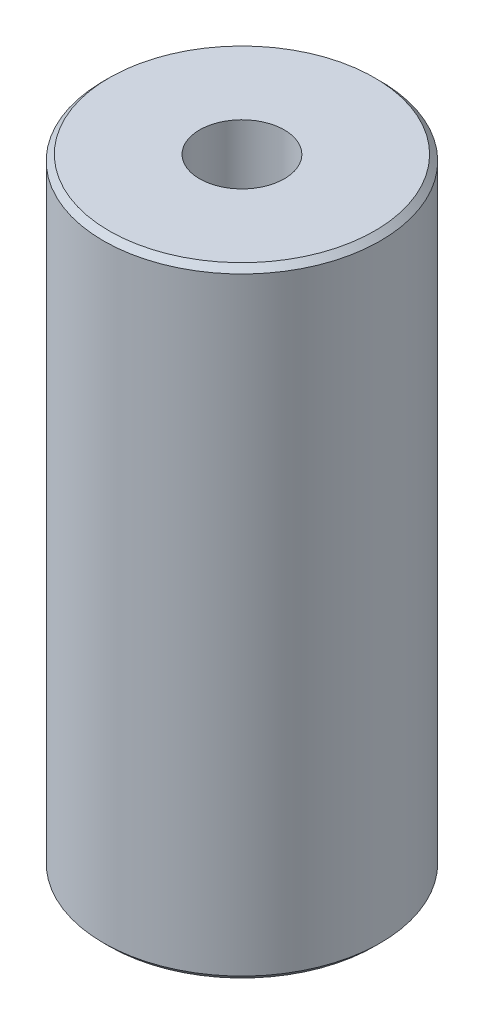
ISO-10303-21;
HEADER;
FILE_DESCRIPTION(('STEP AP214'),'2;1');
FILE_NAME('part.step','',(''),(''),'','','');
FILE_SCHEMA(('AUTOMOTIVE_DESIGN { 1 0 10303 214 1 1 1 1 }'));
ENDSEC;
DATA;
#1=APPLICATION_CONTEXT('core data for automotive mechanical design processes');
#2=APPLICATION_PROTOCOL_DEFINITION('international standard','automotive_design',2000,#1);
#3=PRODUCT_CONTEXT('',#1,'mechanical');
#4=PRODUCT('Part','Part','',(#3));
#5=PRODUCT_RELATED_PRODUCT_CATEGORY('part','',(#4));
#6=PRODUCT_DEFINITION_FORMATION('','',#4);
#7=PRODUCT_DEFINITION_CONTEXT('part definition',#1,'design');
#8=PRODUCT_DEFINITION('design','',#6,#7);
#9=PRODUCT_DEFINITION_SHAPE('','',#8);
#10=(LENGTH_UNIT() NAMED_UNIT(*) SI_UNIT(.MILLI.,.METRE.));
#11=(NAMED_UNIT(*) PLANE_ANGLE_UNIT() SI_UNIT($,.RADIAN.));
#12=(NAMED_UNIT(*) SI_UNIT($,.STERADIAN.) SOLID_ANGLE_UNIT());
#13=UNCERTAINTY_MEASURE_WITH_UNIT(LENGTH_MEASURE(1.E-05),#10,'distance_accuracy_value','');
#14=(GEOMETRIC_REPRESENTATION_CONTEXT(3) GLOBAL_UNCERTAINTY_ASSIGNED_CONTEXT((#13)) GLOBAL_UNIT_ASSIGNED_CONTEXT((#10,
#11,#12)) REPRESENTATION_CONTEXT('',''));
#15=CARTESIAN_POINT('',(0.,0.,0.));
#16=DIRECTION('',(0.,0.,1.));
#17=DIRECTION('',(1.,0.,0.));
#18=AXIS2_PLACEMENT_3D('',#15,#16,#17);
#19=CARTESIAN_POINT('',(0.,145.436498102128,0.));
#20=DIRECTION('',(0.,-1.,0.));
#21=DIRECTION('',(0.,0.,-1.));
#22=AXIS2_PLACEMENT_3D('',#19,#20,#21);
#23=CYLINDRICAL_SURFACE('',#22,32.5);
#24=CARTESIAN_POINT('',(0.,144.089113134862,0.));
#25=DIRECTION('',(0.,1.,0.));
#26=DIRECTION('',(0.,0.,1.));
#27=AXIS2_PLACEMENT_3D('',#24,#25,#26);
#28=CIRCLE('',#27,32.5);
#29=CARTESIAN_POINT('',(0.,144.089113134862,32.5));
#30=VERTEX_POINT('',#29);
#31=EDGE_CURVE('E50',#30,#30,#28,.F.);
#32=ORIENTED_EDGE('',*,*,#31,.T.);
#33=EDGE_LOOP('',(#32));
#34=FACE_BOUND('',#33,.T.);
#35=CARTESIAN_POINT('',(0.,1.34738496726594,0.));
#36=DIRECTION('',(0.,1.,0.));
#37=DIRECTION('',(0.,0.,1.));
#38=AXIS2_PLACEMENT_3D('',#35,#36,#37);
#39=CIRCLE('',#38,32.5);
#40=CARTESIAN_POINT('',(0.,1.34738496726594,32.5));
#41=VERTEX_POINT('',#40);
#42=EDGE_CURVE('E51',#41,#41,#39,.T.);
#43=ORIENTED_EDGE('',*,*,#42,.T.);
#44=EDGE_LOOP('',(#43));
#45=FACE_BOUND('',#44,.T.);
#46=ADVANCED_FACE('F39',(#34,#45),#23,.T.);
#47=CARTESIAN_POINT('',(0.,145.436498102128,0.));
#48=DIRECTION('',(0.,1.,0.));
#49=DIRECTION('',(0.,0.,1.));
#50=AXIS2_PLACEMENT_3D('',#47,#48,#49);
#51=PLANE('',#50);
#52=CARTESIAN_POINT('',(0.,145.436498102128,0.));
#53=DIRECTION('',(0.,1.,0.));
#54=DIRECTION('',(0.,0.,1.));
#55=AXIS2_PLACEMENT_3D('',#52,#53,#54);
#56=CIRCLE('',#55,31.1526150327341);
#57=CARTESIAN_POINT('',(0.,145.436498102128,31.1526150327341));
#58=VERTEX_POINT('',#57);
#59=EDGE_CURVE('E54',#58,#58,#56,.T.);
#60=ORIENTED_EDGE('',*,*,#59,.T.);
#61=EDGE_LOOP('',(#60));
#62=FACE_BOUND('',#61,.T.);
#63=CARTESIAN_POINT('',(0.,145.436498102128,0.));
#64=DIRECTION('',(0.,1.,0.));
#65=DIRECTION('',(0.,0.,1.));
#66=AXIS2_PLACEMENT_3D('',#63,#64,#65);
#67=CIRCLE('',#66,9.95345831325769);
#68=CARTESIAN_POINT('',(0.,145.436498102128,9.95345831325769));
#69=VERTEX_POINT('',#68);
#70=EDGE_CURVE('E58',#69,#69,#67,.T.);
#71=ORIENTED_EDGE('',*,*,#70,.F.);
#72=EDGE_LOOP('',(#71));
#73=FACE_BOUND('',#72,.T.);
#74=ADVANCED_FACE('F69',(#62,#73),#51,.T.);
#75=CARTESIAN_POINT('',(0.,0.,0.));
#76=DIRECTION('',(0.,1.,0.));
#77=DIRECTION('',(0.,0.,1.));
#78=AXIS2_PLACEMENT_3D('',#75,#76,#77);
#79=PLANE('',#78);
#80=CARTESIAN_POINT('',(0.,0.,0.));
#81=DIRECTION('',(0.,1.,0.));
#82=DIRECTION('',(0.,0.,1.));
#83=AXIS2_PLACEMENT_3D('',#80,#81,#82);
#84=CIRCLE('',#83,31.1526150327341);
#85=CARTESIAN_POINT('',(0.,0.,31.1526150327341));
#86=VERTEX_POINT('',#85);
#87=EDGE_CURVE('E10',#86,#86,#84,.F.);
#88=ORIENTED_EDGE('',*,*,#87,.T.);
#89=EDGE_LOOP('',(#88));
#90=FACE_BOUND('',#89,.T.);
#91=CARTESIAN_POINT('',(0.,0.,0.));
#92=DIRECTION('',(0.,1.,0.));
#93=DIRECTION('',(0.,0.,1.));
#94=AXIS2_PLACEMENT_3D('',#91,#92,#93);
#95=CIRCLE('',#94,9.95345831325769);
#96=CARTESIAN_POINT('',(0.,0.,9.95345831325769));
#97=VERTEX_POINT('',#96);
#98=EDGE_CURVE('E63',#97,#97,#95,.T.);
#99=ORIENTED_EDGE('',*,*,#98,.T.);
#100=EDGE_LOOP('',(#99));
#101=FACE_BOUND('',#100,.T.);
#102=ADVANCED_FACE('F75',(#90,#101),#79,.F.);
#103=CARTESIAN_POINT('',(0.,145.436498102128,0.));
#104=DIRECTION('',(0.,-1.,0.));
#105=DIRECTION('',(0.,0.,-1.));
#106=AXIS2_PLACEMENT_3D('',#103,#104,#105);
#107=CYLINDRICAL_SURFACE('',#106,9.95345831325769);
#108=ORIENTED_EDGE('',*,*,#70,.T.);
#109=EDGE_LOOP('',(#108));
#110=FACE_BOUND('',#109,.T.);
#111=ORIENTED_EDGE('',*,*,#98,.F.);
#112=EDGE_LOOP('',(#111));
#113=FACE_BOUND('',#112,.T.);
#114=ADVANCED_FACE('F70',(#110,#113),#107,.F.);
#115=CARTESIAN_POINT('',(0.,145.436498102128,0.));
#116=DIRECTION('',(0.,-1.,0.));
#117=DIRECTION('',(0.,0.,-1.));
#118=AXIS2_PLACEMENT_3D('',#115,#116,#117);
#119=CONICAL_SURFACE('',#118,31.1526150327341,0.785398163397443);
#120=ORIENTED_EDGE('',*,*,#31,.F.);
#121=EDGE_LOOP('',(#120));
#122=FACE_BOUND('',#121,.T.);
#123=ORIENTED_EDGE('',*,*,#59,.F.);
#124=EDGE_LOOP('',(#123));
#125=FACE_BOUND('',#124,.T.);
#126=ADVANCED_FACE('F81',(#122,#125),#119,.T.);
#127=CARTESIAN_POINT('',(0.,1.34738496726594,0.));
#128=DIRECTION('',(0.,1.,0.));
#129=DIRECTION('',(0.,0.,1.));
#130=AXIS2_PLACEMENT_3D('',#127,#128,#129);
#131=CONICAL_SURFACE('',#130,32.5,0.785398163397448);
#132=ORIENTED_EDGE('',*,*,#87,.F.);
#133=EDGE_LOOP('',(#132));
#134=FACE_BOUND('',#133,.T.);
#135=ORIENTED_EDGE('',*,*,#42,.F.);
#136=EDGE_LOOP('',(#135));
#137=FACE_BOUND('',#136,.T.);
#138=ADVANCED_FACE('F45',(#134,#137),#131,.T.);
#139=CLOSED_SHELL('',(#46,#74,#102,#114,#126,#138));
#140=MANIFOLD_SOLID_BREP('B2',#139);
#141=ADVANCED_BREP_SHAPE_REPRESENTATION('',(#18,#140),#14);
#142=SHAPE_DEFINITION_REPRESENTATION(#9,#141);
ENDSEC;
END-ISO-10303-21;
